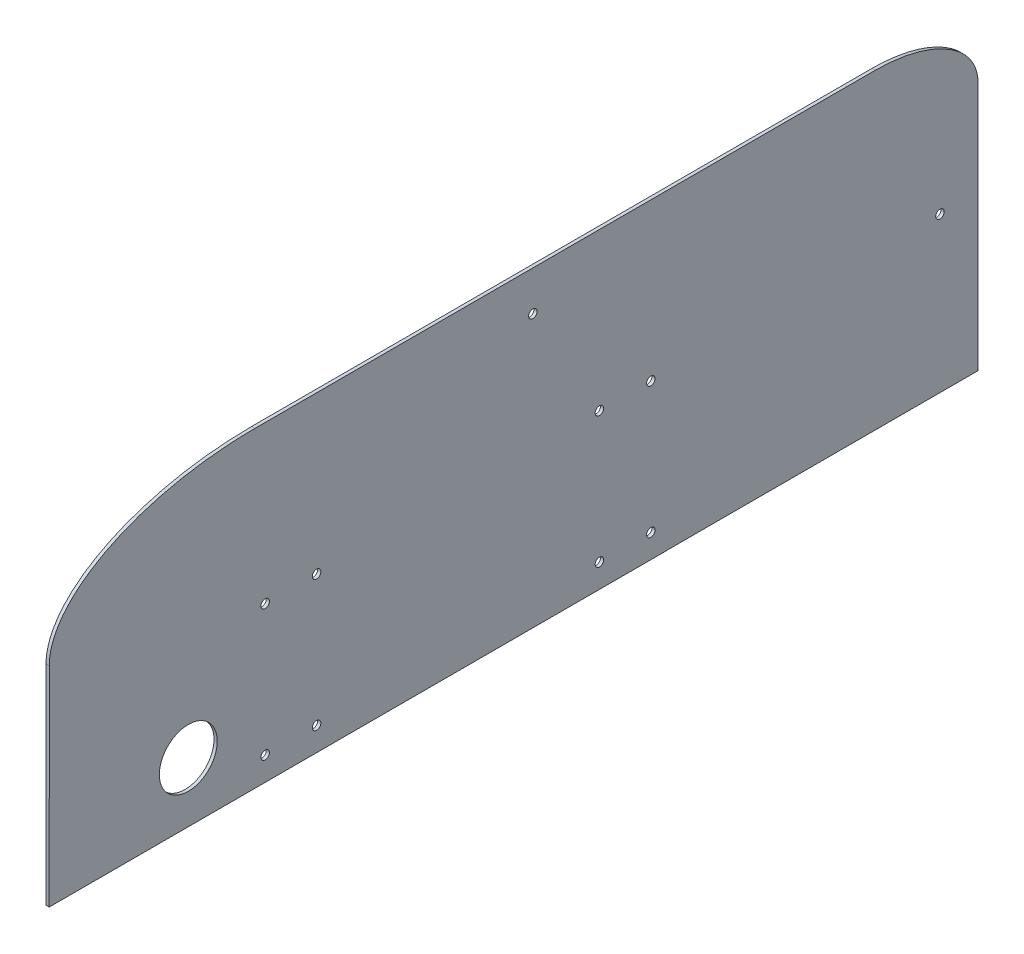
ISO-10303-21;
HEADER;
FILE_DESCRIPTION(('STEP AP214'),'2;1');
FILE_NAME('part.step','',(''),(''),'','','');
FILE_SCHEMA(('AUTOMOTIVE_DESIGN { 1 0 10303 214 1 1 1 1 }'));
ENDSEC;
DATA;
#1=APPLICATION_CONTEXT('core data for automotive mechanical design processes');
#2=APPLICATION_PROTOCOL_DEFINITION('international standard','automotive_design',2000,#1);
#3=PRODUCT_CONTEXT('',#1,'mechanical');
#4=PRODUCT('Part','Part','',(#3));
#5=PRODUCT_RELATED_PRODUCT_CATEGORY('part','',(#4));
#6=PRODUCT_DEFINITION_FORMATION('','',#4);
#7=PRODUCT_DEFINITION_CONTEXT('part definition',#1,'design');
#8=PRODUCT_DEFINITION('design','',#6,#7);
#9=PRODUCT_DEFINITION_SHAPE('','',#8);
#10=(LENGTH_UNIT() NAMED_UNIT(*) SI_UNIT(.MILLI.,.METRE.));
#11=(NAMED_UNIT(*) PLANE_ANGLE_UNIT() SI_UNIT($,.RADIAN.));
#12=(NAMED_UNIT(*) SI_UNIT($,.STERADIAN.) SOLID_ANGLE_UNIT());
#13=UNCERTAINTY_MEASURE_WITH_UNIT(LENGTH_MEASURE(1.E-05),#10,'distance_accuracy_value','');
#14=(GEOMETRIC_REPRESENTATION_CONTEXT(3) GLOBAL_UNCERTAINTY_ASSIGNED_CONTEXT((#13)) GLOBAL_UNIT_ASSIGNED_CONTEXT((#10,
#11,#12)) REPRESENTATION_CONTEXT('',''));
#15=CARTESIAN_POINT('',(0.,0.,0.));
#16=DIRECTION('',(0.,0.,1.));
#17=DIRECTION('',(1.,0.,0.));
#18=AXIS2_PLACEMENT_3D('',#15,#16,#17);
#19=CARTESIAN_POINT('',(1.5875,-58.42,-152.4));
#20=DIRECTION('',(0.,0.,1.));
#21=DIRECTION('',(0.,-1.,0.));
#22=AXIS2_PLACEMENT_3D('',#19,#20,#21);
#23=PLANE('',#22);
#24=DIRECTION('',(-1.,0.,0.));
#25=VECTOR('',#24,1.);
#26=CARTESIAN_POINT('',(485.507501583164,-58.3565,-152.4));
#27=LINE('',#26,#25);
#28=CARTESIAN_POINT('',(1.5875,-58.3565,-152.4));
#29=VERTEX_POINT('',#28);
#30=CARTESIAN_POINT('',(0.,-58.3565,-152.4));
#31=VERTEX_POINT('',#30);
#32=EDGE_CURVE('E134',#29,#31,#27,.T.);
#33=ORIENTED_EDGE('',*,*,#32,.F.);
#34=DIRECTION('',(0.,1.,0.));
#35=VECTOR('',#34,1.);
#36=CARTESIAN_POINT('',(1.5875,-58.42,-152.4));
#37=LINE('',#36,#35);
#38=CARTESIAN_POINT('',(1.5875,-58.42,-152.4));
#39=VERTEX_POINT('',#38);
#40=EDGE_CURVE('E363',#39,#29,#37,.T.);
#41=ORIENTED_EDGE('',*,*,#40,.F.);
#42=DIRECTION('',(-1.,0.,0.));
#43=VECTOR('',#42,1.);
#44=CARTESIAN_POINT('',(1.5875,-58.42,-152.4));
#45=LINE('',#44,#43);
#46=CARTESIAN_POINT('',(0.,-58.42,-152.4));
#47=VERTEX_POINT('',#46);
#48=EDGE_CURVE('E340',#39,#47,#45,.T.);
#49=ORIENTED_EDGE('',*,*,#48,.T.);
#50=DIRECTION('',(0.,1.,0.));
#51=VECTOR('',#50,1.);
#52=CARTESIAN_POINT('',(0.,-58.42,-152.4));
#53=LINE('',#52,#51);
#54=EDGE_CURVE('E356',#47,#31,#53,.T.);
#55=ORIENTED_EDGE('',*,*,#54,.T.);
#56=EDGE_LOOP('',(#33,#41,#49,#55));
#57=FACE_BOUND('',#56,.T.);
#58=ADVANCED_FACE('F46',(#57),#23,.F.);
#59=CARTESIAN_POINT('',(1.5875,-58.42,152.4));
#60=DIRECTION('',(0.,0.,-1.));
#61=DIRECTION('',(-1.,0.,0.));
#62=AXIS2_PLACEMENT_3D('',#59,#60,#61);
#63=PLANE('',#62);
#64=DIRECTION('',(0.,-1.,0.));
#65=VECTOR('',#64,1.);
#66=CARTESIAN_POINT('',(1.5875,-58.42,152.4));
#67=LINE('',#66,#65);
#68=CARTESIAN_POINT('',(1.62718750000001,44.7675,152.4));
#69=VERTEX_POINT('',#68);
#70=CARTESIAN_POINT('',(1.5875,-58.42,152.4));
#71=VERTEX_POINT('',#70);
#72=EDGE_CURVE('E357',#69,#71,#67,.T.);
#73=ORIENTED_EDGE('',*,*,#72,.F.);
#74=CARTESIAN_POINT('',(-0.0793750000000009,44.7675,152.4));
#75=CARTESIAN_POINT('',(0.50270833333334,44.7675,152.4));
#76=CARTESIAN_POINT('',(1.08479166666668,44.7675,152.4));
#77=CARTESIAN_POINT('',(1.66687500000002,44.7675,152.4));
#78=(BOUNDED_CURVE() B_SPLINE_CURVE(3,(#74,#75,#76,#77),.UNSPECIFIED.,.F.,
.F.) B_SPLINE_CURVE_WITH_KNOTS((4,4),(-0.001666875,7.93750000000205E-05),
.UNSPECIFIED.) CURVE() GEOMETRIC_REPRESENTATION_ITEM() RATIONAL_B_SPLINE_CURVE((1.,1.,1.,1.)) REPRESENTATION_ITEM(''));
#79=CARTESIAN_POINT('',(0.,44.7675,152.4));
#80=VERTEX_POINT('',#79);
#81=EDGE_CURVE('E334',#69,#80,#78,.F.);
#82=ORIENTED_EDGE('',*,*,#81,.T.);
#83=DIRECTION('',(0.,-1.,0.));
#84=VECTOR('',#83,1.);
#85=CARTESIAN_POINT('',(0.,-58.42,152.4));
#86=LINE('',#85,#84);
#87=CARTESIAN_POINT('',(0.,-58.42,152.4));
#88=VERTEX_POINT('',#87);
#89=EDGE_CURVE('E351',#80,#88,#86,.T.);
#90=ORIENTED_EDGE('',*,*,#89,.T.);
#91=DIRECTION('',(-1.,0.,0.));
#92=VECTOR('',#91,1.);
#93=CARTESIAN_POINT('',(1.5875,-58.42,152.4));
#94=LINE('',#93,#92);
#95=EDGE_CURVE('E336',#71,#88,#94,.T.);
#96=ORIENTED_EDGE('',*,*,#95,.F.);
#97=EDGE_LOOP('',(#73,#82,#90,#96));
#98=FACE_BOUND('',#97,.T.);
#99=ADVANCED_FACE('F245',(#98),#63,.F.);
#100=CARTESIAN_POINT('',(1.5875,-58.42,152.4));
#101=DIRECTION('',(0.,1.,0.));
#102=DIRECTION('',(0.,0.,1.));
#103=AXIS2_PLACEMENT_3D('',#100,#101,#102);
#104=PLANE('',#103);
#105=DIRECTION('',(0.,0.,-1.));
#106=VECTOR('',#105,1.);
#107=CARTESIAN_POINT('',(0.,-58.42,152.4));
#108=LINE('',#107,#106);
#109=EDGE_CURVE('E355',#88,#47,#108,.T.);
#110=ORIENTED_EDGE('',*,*,#109,.T.);
#111=ORIENTED_EDGE('',*,*,#48,.F.);
#112=DIRECTION('',(0.,0.,-1.));
#113=VECTOR('',#112,1.);
#114=CARTESIAN_POINT('',(1.5875,-58.42,152.4));
#115=LINE('',#114,#113);
#116=EDGE_CURVE('E347',#71,#39,#115,.T.);
#117=ORIENTED_EDGE('',*,*,#116,.F.);
#118=ORIENTED_EDGE('',*,*,#95,.T.);
#119=EDGE_LOOP('',(#110,#111,#117,#118));
#120=FACE_BOUND('',#119,.T.);
#121=ADVANCED_FACE('F242',(#120),#104,.F.);
#122=CARTESIAN_POINT('',(1.5875,0.,0.));
#123=DIRECTION('',(-1.,0.,0.));
#124=DIRECTION('',(0.,0.,1.));
#125=AXIS2_PLACEMENT_3D('',#122,#123,#124);
#126=PLANE('',#125);
#127=CARTESIAN_POINT('',(1.5875,75.936579902,-86.5099811579999));
#128=DIRECTION('',(-1.,0.,0.));
#129=DIRECTION('',(0.,0.,1.));
#130=AXIS2_PLACEMENT_3D('',#127,#128,#129);
#131=CIRCLE('',#130,2.0955);
#132=CARTESIAN_POINT('',(1.5875,75.936579902,-84.4144811579999));
#133=VERTEX_POINT('',#132);
#134=EDGE_CURVE('E518',#133,#133,#131,.F.);
#135=ORIENTED_EDGE('',*,*,#134,.F.);
#136=EDGE_LOOP('',(#135));
#137=FACE_BOUND('',#136,.T.);
#138=CARTESIAN_POINT('',(1.5875,18.034,-287.5915));
#139=DIRECTION('',(-1.,0.,0.));
#140=DIRECTION('',(0.,0.,1.));
#141=AXIS2_PLACEMENT_3D('',#138,#139,#140);
#142=CIRCLE('',#141,2.09549999999999);
#143=CARTESIAN_POINT('',(1.5875,18.034,-285.496));
#144=VERTEX_POINT('',#143);
#145=EDGE_CURVE('E217',#144,#144,#142,.F.);
#146=ORIENTED_EDGE('',*,*,#145,.F.);
#147=EDGE_LOOP('',(#146));
#148=FACE_BOUND('',#147,.T.);
#149=DIRECTION('',(0.,1.,0.));
#150=VECTOR('',#149,1.);
#151=CARTESIAN_POINT('',(1.58750000000002,0.,-306.3875));
#152=LINE('',#151,#150);
#153=CARTESIAN_POINT('',(1.58750000000002,-58.3565,-306.3875));
#154=VERTEX_POINT('',#153);
#155=CARTESIAN_POINT('',(1.58750000000002,65.0875,-306.3875));
#156=VERTEX_POINT('',#155);
#157=EDGE_CURVE('E130',#154,#156,#152,.T.);
#158=ORIENTED_EDGE('',*,*,#157,.T.);
#159=CARTESIAN_POINT('',(1.58750000000002,95.5675,-255.5875));
#160=CARTESIAN_POINT('',(1.58750000000002,95.5675,-306.3875));
#161=CARTESIAN_POINT('',(1.58750000000002,65.0875,-306.3875));
#162=(BOUNDED_CURVE() B_SPLINE_CURVE(2,(#159,#160,#161),.UNSPECIFIED.,.F.,
.F.) B_SPLINE_CURVE_WITH_KNOTS((3,3),(0.,1.),
.UNSPECIFIED.) CURVE() GEOMETRIC_REPRESENTATION_ITEM() RATIONAL_B_SPLINE_CURVE((1.,
0.707106781186548,1.)) REPRESENTATION_ITEM(''));
#163=CARTESIAN_POINT('',(1.58750000000002,95.5675,-255.5875));
#164=VERTEX_POINT('',#163);
#165=EDGE_CURVE('E13',#156,#164,#162,.F.);
#166=ORIENTED_EDGE('',*,*,#165,.T.);
#167=DIRECTION('',(0.,0.,1.));
#168=VECTOR('',#167,1.);
#169=CARTESIAN_POINT('',(1.58750000000002,95.5675,0.));
#170=LINE('',#169,#168);
#171=CARTESIAN_POINT('',(1.58750000000002,95.5675,50.8));
#172=VERTEX_POINT('',#171);
#173=EDGE_CURVE('E154',#164,#172,#170,.T.);
#174=ORIENTED_EDGE('',*,*,#173,.T.);
#175=CARTESIAN_POINT('',(1.5875,44.7675,152.4));
#176=CARTESIAN_POINT('',(1.5875,95.5675,152.4));
#177=CARTESIAN_POINT('',(1.5875,95.5675,50.8));
#178=(BOUNDED_CURVE() B_SPLINE_CURVE(2,(#175,#176,#177),.UNSPECIFIED.,.F.,
.F.) B_SPLINE_CURVE_WITH_KNOTS((3,3),(0.,1.),
.UNSPECIFIED.) CURVE() GEOMETRIC_REPRESENTATION_ITEM() RATIONAL_B_SPLINE_CURVE((1.,
0.707106781186547,1.)) REPRESENTATION_ITEM(''));
#179=EDGE_CURVE('E330',#172,#69,#178,.F.);
#180=ORIENTED_EDGE('',*,*,#179,.T.);
#181=ORIENTED_EDGE('',*,*,#72,.T.);
#182=ORIENTED_EDGE('',*,*,#116,.T.);
#183=ORIENTED_EDGE('',*,*,#40,.T.);
#184=DIRECTION('',(0.,0.,1.));
#185=VECTOR('',#184,1.);
#186=CARTESIAN_POINT('',(1.58750000000002,-58.3565,0.));
#187=LINE('',#186,#185);
#188=EDGE_CURVE('E145',#154,#29,#187,.T.);
#189=ORIENTED_EDGE('',*,*,#188,.F.);
#190=EDGE_LOOP('',(#158,#166,#174,#180,#181,#182,#183,#189));
#191=FACE_BOUND('',#190,.T.);
#192=CARTESIAN_POINT('',(1.5875,-28.956,83.7057));
#193=DIRECTION('',(-1.,0.,0.));
#194=DIRECTION('',(0.,0.,1.));
#195=AXIS2_PLACEMENT_3D('',#192,#193,#194);
#196=CIRCLE('',#195,14.2875);
#197=CARTESIAN_POINT('',(1.5875,-28.956,97.9932));
#198=VERTEX_POINT('',#197);
#199=EDGE_CURVE('E430',#198,#198,#196,.T.);
#200=ORIENTED_EDGE('',*,*,#199,.T.);
#201=EDGE_LOOP('',(#200));
#202=FACE_BOUND('',#201,.T.);
#203=CARTESIAN_POINT('',(1.5875,-46.736,-144.78));
#204=DIRECTION('',(1.,0.,0.));
#205=DIRECTION('',(0.,0.,-1.));
#206=AXIS2_PLACEMENT_3D('',#203,#204,#205);
#207=CIRCLE('',#206,2.09550000000002);
#208=CARTESIAN_POINT('',(1.5875,-46.736,-146.8755));
#209=VERTEX_POINT('',#208);
#210=EDGE_CURVE('E390',#209,#209,#207,.T.);
#211=ORIENTED_EDGE('',*,*,#210,.F.);
#212=EDGE_LOOP('',(#211));
#213=FACE_BOUND('',#212,.T.);
#214=CARTESIAN_POINT('',(1.5875,-46.736,-119.38));
#215=DIRECTION('',(1.,0.,0.));
#216=DIRECTION('',(0.,0.,-1.));
#217=AXIS2_PLACEMENT_3D('',#214,#215,#216);
#218=CIRCLE('',#217,2.0955);
#219=CARTESIAN_POINT('',(1.5875,-46.736,-121.4755));
#220=VERTEX_POINT('',#219);
#221=EDGE_CURVE('E407',#220,#220,#218,.T.);
#222=ORIENTED_EDGE('',*,*,#221,.F.);
#223=EDGE_LOOP('',(#222));
#224=FACE_BOUND('',#223,.T.);
#225=CARTESIAN_POINT('',(1.5875,18.034,45.7200000000002));
#226=DIRECTION('',(1.,0.,0.));
#227=DIRECTION('',(0.,0.,-1.));
#228=AXIS2_PLACEMENT_3D('',#225,#226,#227);
#229=CIRCLE('',#228,2.0955);
#230=CARTESIAN_POINT('',(1.5875,18.034,43.6245000000002));
#231=VERTEX_POINT('',#230);
#232=EDGE_CURVE('E397',#231,#231,#229,.T.);
#233=ORIENTED_EDGE('',*,*,#232,.F.);
#234=EDGE_LOOP('',(#233));
#235=FACE_BOUND('',#234,.T.);
#236=CARTESIAN_POINT('',(1.5875,18.034,20.3200000000002));
#237=DIRECTION('',(1.,0.,0.));
#238=DIRECTION('',(0.,0.,-1.));
#239=AXIS2_PLACEMENT_3D('',#236,#237,#238);
#240=CIRCLE('',#239,2.0955);
#241=CARTESIAN_POINT('',(1.5875,18.034,18.2245000000002));
#242=VERTEX_POINT('',#241);
#243=EDGE_CURVE('E398',#242,#242,#240,.T.);
#244=ORIENTED_EDGE('',*,*,#243,.F.);
#245=EDGE_LOOP('',(#244));
#246=FACE_BOUND('',#245,.T.);
#247=CARTESIAN_POINT('',(1.5875,18.034,-119.38));
#248=DIRECTION('',(1.,0.,0.));
#249=DIRECTION('',(0.,0.,-1.));
#250=AXIS2_PLACEMENT_3D('',#247,#248,#249);
#251=CIRCLE('',#250,2.0955);
#252=CARTESIAN_POINT('',(1.5875,18.034,-121.4755));
#253=VERTEX_POINT('',#252);
#254=EDGE_CURVE('E435',#253,#253,#251,.T.);
#255=ORIENTED_EDGE('',*,*,#254,.F.);
#256=EDGE_LOOP('',(#255));
#257=FACE_BOUND('',#256,.T.);
#258=CARTESIAN_POINT('',(1.5875,18.034,-144.78));
#259=DIRECTION('',(1.,0.,0.));
#260=DIRECTION('',(0.,0.,-1.));
#261=AXIS2_PLACEMENT_3D('',#258,#259,#260);
#262=CIRCLE('',#261,2.09550000000002);
#263=CARTESIAN_POINT('',(1.5875,18.034,-146.8755));
#264=VERTEX_POINT('',#263);
#265=EDGE_CURVE('E425',#264,#264,#262,.T.);
#266=ORIENTED_EDGE('',*,*,#265,.F.);
#267=EDGE_LOOP('',(#266));
#268=FACE_BOUND('',#267,.T.);
#269=CARTESIAN_POINT('',(1.5875,-46.736,20.32));
#270=DIRECTION('',(1.,0.,0.));
#271=DIRECTION('',(0.,0.,-1.));
#272=AXIS2_PLACEMENT_3D('',#269,#270,#271);
#273=CIRCLE('',#272,2.0955);
#274=CARTESIAN_POINT('',(1.5875,-46.736,18.2245));
#275=VERTEX_POINT('',#274);
#276=EDGE_CURVE('E426',#275,#275,#273,.T.);
#277=ORIENTED_EDGE('',*,*,#276,.F.);
#278=EDGE_LOOP('',(#277));
#279=FACE_BOUND('',#278,.T.);
#280=CARTESIAN_POINT('',(1.5875,-46.736,45.72));
#281=DIRECTION('',(1.,0.,0.));
#282=DIRECTION('',(0.,0.,-1.));
#283=AXIS2_PLACEMENT_3D('',#280,#281,#282);
#284=CIRCLE('',#283,2.0955);
#285=CARTESIAN_POINT('',(1.5875,-46.736,43.6245));
#286=VERTEX_POINT('',#285);
#287=EDGE_CURVE('E380',#286,#286,#284,.T.);
#288=ORIENTED_EDGE('',*,*,#287,.F.);
#289=EDGE_LOOP('',(#288));
#290=FACE_BOUND('',#289,.T.);
#291=ADVANCED_FACE('F238',(#137,#148,#191,#202,#213,#224,#235,#246,#257,#268,#279,#290),#126,.F.);
#292=CARTESIAN_POINT('',(0.,0.,0.));
#293=DIRECTION('',(-1.,0.,0.));
#294=DIRECTION('',(0.,0.,1.));
#295=AXIS2_PLACEMENT_3D('',#292,#293,#294);
#296=PLANE('',#295);
#297=CARTESIAN_POINT('',(0.,75.936579902,-86.5099811579999));
#298=DIRECTION('',(-1.,0.,0.));
#299=DIRECTION('',(0.,0.,1.));
#300=AXIS2_PLACEMENT_3D('',#297,#298,#299);
#301=CIRCLE('',#300,2.0955);
#302=CARTESIAN_POINT('',(0.,75.936579902,-84.4144811579999));
#303=VERTEX_POINT('',#302);
#304=EDGE_CURVE('E530',#303,#303,#301,.T.);
#305=ORIENTED_EDGE('',*,*,#304,.F.);
#306=EDGE_LOOP('',(#305));
#307=FACE_BOUND('',#306,.T.);
#308=CARTESIAN_POINT('',(0.,18.034,-287.5915));
#309=DIRECTION('',(-1.,0.,0.));
#310=DIRECTION('',(0.,0.,1.));
#311=AXIS2_PLACEMENT_3D('',#308,#309,#310);
#312=CIRCLE('',#311,2.09549999999999);
#313=CARTESIAN_POINT('',(0.,18.034,-285.496));
#314=VERTEX_POINT('',#313);
#315=EDGE_CURVE('E523',#314,#314,#312,.T.);
#316=ORIENTED_EDGE('',*,*,#315,.F.);
#317=EDGE_LOOP('',(#316));
#318=FACE_BOUND('',#317,.T.);
#319=DIRECTION('',(0.,0.,-1.));
#320=VECTOR('',#319,1.);
#321=CARTESIAN_POINT('',(0.,95.5675,0.));
#322=LINE('',#321,#320);
#323=CARTESIAN_POINT('',(-0.0396875000000005,95.5675,50.8));
#324=VERTEX_POINT('',#323);
#325=CARTESIAN_POINT('',(0.,95.5675,-255.5875));
#326=VERTEX_POINT('',#325);
#327=EDGE_CURVE('E125',#324,#326,#322,.T.);
#328=ORIENTED_EDGE('',*,*,#327,.T.);
#329=CARTESIAN_POINT('',(0.,65.0875,-306.3875));
#330=CARTESIAN_POINT('',(0.,95.5675,-306.3875));
#331=CARTESIAN_POINT('',(0.,95.5675,-255.5875));
#332=(BOUNDED_CURVE() B_SPLINE_CURVE(2,(#329,#330,#331),.UNSPECIFIED.,.F.,
.F.) B_SPLINE_CURVE_WITH_KNOTS((3,3),(0.,1.),
.UNSPECIFIED.) CURVE() GEOMETRIC_REPRESENTATION_ITEM() RATIONAL_B_SPLINE_CURVE((1.,
0.707106781186548,1.)) REPRESENTATION_ITEM(''));
#333=CARTESIAN_POINT('',(0.,65.0875,-306.3875));
#334=VERTEX_POINT('',#333);
#335=EDGE_CURVE('E76',#326,#334,#332,.F.);
#336=ORIENTED_EDGE('',*,*,#335,.T.);
#337=DIRECTION('',(0.,-1.,0.));
#338=VECTOR('',#337,1.);
#339=CARTESIAN_POINT('',(0.,0.,-306.3875));
#340=LINE('',#339,#338);
#341=CARTESIAN_POINT('',(0.,-58.3565,-306.3875));
#342=VERTEX_POINT('',#341);
#343=EDGE_CURVE('E117',#334,#342,#340,.T.);
#344=ORIENTED_EDGE('',*,*,#343,.T.);
#345=DIRECTION('',(0.,0.,-1.));
#346=VECTOR('',#345,1.);
#347=CARTESIAN_POINT('',(0.,-58.3565,0.));
#348=LINE('',#347,#346);
#349=EDGE_CURVE('E123',#31,#342,#348,.T.);
#350=ORIENTED_EDGE('',*,*,#349,.F.);
#351=ORIENTED_EDGE('',*,*,#54,.F.);
#352=ORIENTED_EDGE('',*,*,#109,.F.);
#353=ORIENTED_EDGE('',*,*,#89,.F.);
#354=CARTESIAN_POINT('',(0.,95.5675,50.8));
#355=CARTESIAN_POINT('',(0.,95.5675,152.4));
#356=CARTESIAN_POINT('',(0.,44.7675,152.4));
#357=(BOUNDED_CURVE() B_SPLINE_CURVE(2,(#354,#355,#356),.UNSPECIFIED.,.F.,
.F.) B_SPLINE_CURVE_WITH_KNOTS((3,3),(0.,1.),
.UNSPECIFIED.) CURVE() GEOMETRIC_REPRESENTATION_ITEM() RATIONAL_B_SPLINE_CURVE((1.,
0.707106781186547,1.)) REPRESENTATION_ITEM(''));
#358=EDGE_CURVE('E224',#80,#324,#357,.F.);
#359=ORIENTED_EDGE('',*,*,#358,.T.);
#360=EDGE_LOOP('',(#328,#336,#344,#350,#351,#352,#353,#359));
#361=FACE_BOUND('',#360,.T.);
#362=CARTESIAN_POINT('',(0.,-28.956,83.7057));
#363=DIRECTION('',(-1.,0.,0.));
#364=DIRECTION('',(0.,0.,1.));
#365=AXIS2_PLACEMENT_3D('',#362,#363,#364);
#366=CIRCLE('',#365,14.2875);
#367=CARTESIAN_POINT('',(0.,-28.956,97.9932));
#368=VERTEX_POINT('',#367);
#369=EDGE_CURVE('E149',#368,#368,#366,.T.);
#370=ORIENTED_EDGE('',*,*,#369,.F.);
#371=EDGE_LOOP('',(#370));
#372=FACE_BOUND('',#371,.T.);
#373=CARTESIAN_POINT('',(0.,-46.736,-144.78));
#374=DIRECTION('',(-1.,0.,0.));
#375=DIRECTION('',(0.,0.,1.));
#376=AXIS2_PLACEMENT_3D('',#373,#374,#375);
#377=CIRCLE('',#376,2.09550000000002);
#378=CARTESIAN_POINT('',(0.,-46.736,-142.6845));
#379=VERTEX_POINT('',#378);
#380=EDGE_CURVE('E385',#379,#379,#377,.F.);
#381=ORIENTED_EDGE('',*,*,#380,.T.);
#382=EDGE_LOOP('',(#381));
#383=FACE_BOUND('',#382,.T.);
#384=CARTESIAN_POINT('',(0.,-46.736,-119.38));
#385=DIRECTION('',(-1.,0.,0.));
#386=DIRECTION('',(0.,0.,1.));
#387=AXIS2_PLACEMENT_3D('',#384,#385,#386);
#388=CIRCLE('',#387,2.0955);
#389=CARTESIAN_POINT('',(0.,-46.736,-117.2845));
#390=VERTEX_POINT('',#389);
#391=EDGE_CURVE('E411',#390,#390,#388,.F.);
#392=ORIENTED_EDGE('',*,*,#391,.T.);
#393=EDGE_LOOP('',(#392));
#394=FACE_BOUND('',#393,.T.);
#395=CARTESIAN_POINT('',(0.,18.034,45.7200000000002));
#396=DIRECTION('',(-1.,0.,0.));
#397=DIRECTION('',(0.,0.,1.));
#398=AXIS2_PLACEMENT_3D('',#395,#396,#397);
#399=CIRCLE('',#398,2.0955);
#400=CARTESIAN_POINT('',(0.,18.034,47.8155000000002));
#401=VERTEX_POINT('',#400);
#402=EDGE_CURVE('E403',#401,#401,#399,.F.);
#403=ORIENTED_EDGE('',*,*,#402,.T.);
#404=EDGE_LOOP('',(#403));
#405=FACE_BOUND('',#404,.T.);
#406=CARTESIAN_POINT('',(0.,18.034,20.3200000000002));
#407=DIRECTION('',(-1.,0.,0.));
#408=DIRECTION('',(0.,0.,1.));
#409=AXIS2_PLACEMENT_3D('',#406,#407,#408);
#410=CIRCLE('',#409,2.0955);
#411=CARTESIAN_POINT('',(0.,18.034,22.4155000000002));
#412=VERTEX_POINT('',#411);
#413=EDGE_CURVE('E393',#412,#412,#410,.F.);
#414=ORIENTED_EDGE('',*,*,#413,.T.);
#415=EDGE_LOOP('',(#414));
#416=FACE_BOUND('',#415,.T.);
#417=CARTESIAN_POINT('',(0.,18.034,-119.38));
#418=DIRECTION('',(-1.,0.,0.));
#419=DIRECTION('',(0.,0.,1.));
#420=AXIS2_PLACEMENT_3D('',#417,#418,#419);
#421=CIRCLE('',#420,2.0955);
#422=CARTESIAN_POINT('',(0.,18.034,-117.2845));
#423=VERTEX_POINT('',#422);
#424=EDGE_CURVE('E402',#423,#423,#421,.F.);
#425=ORIENTED_EDGE('',*,*,#424,.T.);
#426=EDGE_LOOP('',(#425));
#427=FACE_BOUND('',#426,.T.);
#428=CARTESIAN_POINT('',(0.,18.034,-144.78));
#429=DIRECTION('',(-1.,0.,0.));
#430=DIRECTION('',(0.,0.,1.));
#431=AXIS2_PLACEMENT_3D('',#428,#429,#430);
#432=CIRCLE('',#431,2.09550000000002);
#433=CARTESIAN_POINT('',(0.,18.034,-142.6845));
#434=VERTEX_POINT('',#433);
#435=EDGE_CURVE('E431',#434,#434,#432,.F.);
#436=ORIENTED_EDGE('',*,*,#435,.T.);
#437=EDGE_LOOP('',(#436));
#438=FACE_BOUND('',#437,.T.);
#439=CARTESIAN_POINT('',(0.,-46.736,20.32));
#440=DIRECTION('',(-1.,0.,0.));
#441=DIRECTION('',(0.,0.,1.));
#442=AXIS2_PLACEMENT_3D('',#439,#440,#441);
#443=CIRCLE('',#442,2.0955);
#444=CARTESIAN_POINT('',(0.,-46.736,22.4155));
#445=VERTEX_POINT('',#444);
#446=EDGE_CURVE('E421',#445,#445,#443,.F.);
#447=ORIENTED_EDGE('',*,*,#446,.T.);
#448=EDGE_LOOP('',(#447));
#449=FACE_BOUND('',#448,.T.);
#450=CARTESIAN_POINT('',(0.,-46.736,45.72));
#451=DIRECTION('',(-1.,0.,0.));
#452=DIRECTION('',(0.,0.,1.));
#453=AXIS2_PLACEMENT_3D('',#450,#451,#452);
#454=CIRCLE('',#453,2.0955);
#455=CARTESIAN_POINT('',(0.,-46.736,47.8155));
#456=VERTEX_POINT('',#455);
#457=EDGE_CURVE('E372',#456,#456,#454,.F.);
#458=ORIENTED_EDGE('',*,*,#457,.T.);
#459=EDGE_LOOP('',(#458));
#460=FACE_BOUND('',#459,.T.);
#461=ADVANCED_FACE('F119',(#307,#318,#361,#372,#383,#394,#405,#416,#427,#438,#449,#460),#296,.T.);
#462=CARTESIAN_POINT('',(-5.9269690399057,-46.736,45.72));
#463=DIRECTION('',(1.,0.,0.));
#464=DIRECTION('',(0.,0.,-1.));
#465=AXIS2_PLACEMENT_3D('',#462,#463,#464);
#466=CYLINDRICAL_SURFACE('',#465,2.0955);
#467=ORIENTED_EDGE('',*,*,#287,.T.);
#468=EDGE_LOOP('',(#467));
#469=FACE_BOUND('',#468,.T.);
#470=ORIENTED_EDGE('',*,*,#457,.F.);
#471=EDGE_LOOP('',(#470));
#472=FACE_BOUND('',#471,.T.);
#473=ADVANCED_FACE('F237',(#469,#472),#466,.F.);
#474=CARTESIAN_POINT('',(-5.9269690399057,-46.736,20.32));
#475=DIRECTION('',(1.,0.,0.));
#476=DIRECTION('',(0.,0.,-1.));
#477=AXIS2_PLACEMENT_3D('',#474,#475,#476);
#478=CYLINDRICAL_SURFACE('',#477,2.0955);
#479=ORIENTED_EDGE('',*,*,#276,.T.);
#480=EDGE_LOOP('',(#479));
#481=FACE_BOUND('',#480,.T.);
#482=ORIENTED_EDGE('',*,*,#446,.F.);
#483=EDGE_LOOP('',(#482));
#484=FACE_BOUND('',#483,.T.);
#485=ADVANCED_FACE('F467',(#481,#484),#478,.F.);
#486=CARTESIAN_POINT('',(-5.9269690399057,18.034,-144.78));
#487=DIRECTION('',(1.,0.,0.));
#488=DIRECTION('',(0.,0.,-1.));
#489=AXIS2_PLACEMENT_3D('',#486,#487,#488);
#490=CYLINDRICAL_SURFACE('',#489,2.09550000000002);
#491=ORIENTED_EDGE('',*,*,#265,.T.);
#492=EDGE_LOOP('',(#491));
#493=FACE_BOUND('',#492,.T.);
#494=ORIENTED_EDGE('',*,*,#435,.F.);
#495=EDGE_LOOP('',(#494));
#496=FACE_BOUND('',#495,.T.);
#497=ADVANCED_FACE('F469',(#493,#496),#490,.F.);
#498=CARTESIAN_POINT('',(-5.9269690399057,18.034,-119.38));
#499=DIRECTION('',(1.,0.,0.));
#500=DIRECTION('',(0.,0.,-1.));
#501=AXIS2_PLACEMENT_3D('',#498,#499,#500);
#502=CYLINDRICAL_SURFACE('',#501,2.0955);
#503=ORIENTED_EDGE('',*,*,#254,.T.);
#504=EDGE_LOOP('',(#503));
#505=FACE_BOUND('',#504,.T.);
#506=ORIENTED_EDGE('',*,*,#424,.F.);
#507=EDGE_LOOP('',(#506));
#508=FACE_BOUND('',#507,.T.);
#509=ADVANCED_FACE('F476',(#505,#508),#502,.F.);
#510=CARTESIAN_POINT('',(-5.9269690399057,18.034,20.3200000000002));
#511=DIRECTION('',(1.,0.,0.));
#512=DIRECTION('',(0.,0.,-1.));
#513=AXIS2_PLACEMENT_3D('',#510,#511,#512);
#514=CYLINDRICAL_SURFACE('',#513,2.0955);
#515=ORIENTED_EDGE('',*,*,#243,.T.);
#516=EDGE_LOOP('',(#515));
#517=FACE_BOUND('',#516,.T.);
#518=ORIENTED_EDGE('',*,*,#413,.F.);
#519=EDGE_LOOP('',(#518));
#520=FACE_BOUND('',#519,.T.);
#521=ADVANCED_FACE('F491',(#517,#520),#514,.F.);
#522=CARTESIAN_POINT('',(-5.9269690399057,18.034,45.7200000000002));
#523=DIRECTION('',(1.,0.,0.));
#524=DIRECTION('',(0.,0.,-1.));
#525=AXIS2_PLACEMENT_3D('',#522,#523,#524);
#526=CYLINDRICAL_SURFACE('',#525,2.0955);
#527=ORIENTED_EDGE('',*,*,#232,.T.);
#528=EDGE_LOOP('',(#527));
#529=FACE_BOUND('',#528,.T.);
#530=ORIENTED_EDGE('',*,*,#402,.F.);
#531=EDGE_LOOP('',(#530));
#532=FACE_BOUND('',#531,.T.);
#533=ADVANCED_FACE('F487',(#529,#532),#526,.F.);
#534=CARTESIAN_POINT('',(-5.9269690399057,-46.736,-119.38));
#535=DIRECTION('',(1.,0.,0.));
#536=DIRECTION('',(0.,0.,-1.));
#537=AXIS2_PLACEMENT_3D('',#534,#535,#536);
#538=CYLINDRICAL_SURFACE('',#537,2.0955);
#539=ORIENTED_EDGE('',*,*,#221,.T.);
#540=EDGE_LOOP('',(#539));
#541=FACE_BOUND('',#540,.T.);
#542=ORIENTED_EDGE('',*,*,#391,.F.);
#543=EDGE_LOOP('',(#542));
#544=FACE_BOUND('',#543,.T.);
#545=ADVANCED_FACE('F483',(#541,#544),#538,.F.);
#546=CARTESIAN_POINT('',(-5.9269690399057,-46.736,-144.78));
#547=DIRECTION('',(1.,0.,0.));
#548=DIRECTION('',(0.,0.,-1.));
#549=AXIS2_PLACEMENT_3D('',#546,#547,#548);
#550=CYLINDRICAL_SURFACE('',#549,2.09550000000002);
#551=ORIENTED_EDGE('',*,*,#210,.T.);
#552=EDGE_LOOP('',(#551));
#553=FACE_BOUND('',#552,.T.);
#554=ORIENTED_EDGE('',*,*,#380,.F.);
#555=EDGE_LOOP('',(#554));
#556=FACE_BOUND('',#555,.T.);
#557=ADVANCED_FACE('F480',(#553,#556),#550,.F.);
#558=CARTESIAN_POINT('',(3.175,-28.956,83.7057));
#559=DIRECTION('',(-1.,0.,0.));
#560=DIRECTION('',(0.,0.,1.));
#561=AXIS2_PLACEMENT_3D('',#558,#559,#560);
#562=CYLINDRICAL_SURFACE('',#561,14.2875);
#563=ORIENTED_EDGE('',*,*,#369,.T.);
#564=EDGE_LOOP('',(#563));
#565=FACE_BOUND('',#564,.T.);
#566=ORIENTED_EDGE('',*,*,#199,.F.);
#567=EDGE_LOOP('',(#566));
#568=FACE_BOUND('',#567,.T.);
#569=ADVANCED_FACE('F179',(#565,#568),#562,.F.);
#570=CARTESIAN_POINT('',(485.507501583164,95.5675,0.));
#571=DIRECTION('',(0.,1.,0.));
#572=DIRECTION('',(0.,0.,1.));
#573=AXIS2_PLACEMENT_3D('',#570,#571,#572);
#574=PLANE('',#573);
#575=ORIENTED_EDGE('',*,*,#173,.F.);
#576=CARTESIAN_POINT('',(-0.0793750000000482,95.5675,-255.5875));
#577=CARTESIAN_POINT('',(0.502708333333306,95.5675,-255.5875));
#578=CARTESIAN_POINT('',(1.08479166666666,95.5675,-255.5875));
#579=CARTESIAN_POINT('',(1.66687500000001,95.5675,-255.5875));
#580=(BOUNDED_CURVE() B_SPLINE_CURVE(3,(#576,#577,#578,#579),.UNSPECIFIED.,.F.,
.F.) B_SPLINE_CURVE_WITH_KNOTS((4,4),(0.483840626583164,0.485586876583164),
.UNSPECIFIED.) CURVE() GEOMETRIC_REPRESENTATION_ITEM() RATIONAL_B_SPLINE_CURVE((1.,1.,1.,1.)) REPRESENTATION_ITEM(''));
#581=EDGE_CURVE('E202',#164,#326,#580,.F.);
#582=ORIENTED_EDGE('',*,*,#581,.T.);
#583=ORIENTED_EDGE('',*,*,#327,.F.);
#584=CARTESIAN_POINT('',(1.66687500000002,95.5675,50.8));
#585=CARTESIAN_POINT('',(1.08479166666668,95.5675,50.8));
#586=CARTESIAN_POINT('',(0.50270833333334,95.5675,50.8));
#587=CARTESIAN_POINT('',(-0.0793750000000009,95.5675,50.8));
#588=(BOUNDED_CURVE() B_SPLINE_CURVE(3,(#584,#585,#586,#587),.UNSPECIFIED.,.F.,
.F.) B_SPLINE_CURVE_WITH_KNOTS((4,4),(-0.001666875,7.93750000000204E-05),
.UNSPECIFIED.) CURVE() GEOMETRIC_REPRESENTATION_ITEM() RATIONAL_B_SPLINE_CURVE((1.,1.,1.,1.)) REPRESENTATION_ITEM(''));
#589=EDGE_CURVE('E327',#324,#172,#588,.F.);
#590=ORIENTED_EDGE('',*,*,#589,.T.);
#591=EDGE_LOOP('',(#575,#582,#583,#590));
#592=FACE_BOUND('',#591,.T.);
#593=ADVANCED_FACE('F175',(#592),#574,.T.);
#594=CARTESIAN_POINT('',(485.507501583164,-58.3565,0.));
#595=DIRECTION('',(0.,1.,0.));
#596=DIRECTION('',(0.,0.,1.));
#597=AXIS2_PLACEMENT_3D('',#594,#595,#596);
#598=PLANE('',#597);
#599=DIRECTION('',(-1.,0.,0.));
#600=VECTOR('',#599,1.);
#601=CARTESIAN_POINT('',(485.507501583164,-58.3565,-306.3875));
#602=LINE('',#601,#600);
#603=EDGE_CURVE('E128',#154,#342,#602,.T.);
#604=ORIENTED_EDGE('',*,*,#603,.F.);
#605=ORIENTED_EDGE('',*,*,#188,.T.);
#606=ORIENTED_EDGE('',*,*,#32,.T.);
#607=ORIENTED_EDGE('',*,*,#349,.T.);
#608=EDGE_LOOP('',(#604,#605,#606,#607));
#609=FACE_BOUND('',#608,.T.);
#610=ADVANCED_FACE('F137',(#609),#598,.F.);
#611=CARTESIAN_POINT('',(485.507501583164,0.,-306.3875));
#612=DIRECTION('',(0.,0.,-1.));
#613=DIRECTION('',(-1.,0.,0.));
#614=AXIS2_PLACEMENT_3D('',#611,#612,#613);
#615=PLANE('',#614);
#616=ORIENTED_EDGE('',*,*,#343,.F.);
#617=CARTESIAN_POINT('',(1.66687500000001,65.0875,-306.3875));
#618=CARTESIAN_POINT('',(1.08479166666666,65.0875,-306.3875));
#619=CARTESIAN_POINT('',(0.502708333333306,65.0875,-306.3875));
#620=CARTESIAN_POINT('',(-0.0793750000000482,65.0875,-306.3875));
#621=(BOUNDED_CURVE() B_SPLINE_CURVE(3,(#617,#618,#619,#620),.UNSPECIFIED.,.F.,
.F.) B_SPLINE_CURVE_WITH_KNOTS((4,4),(0.483840626583164,0.485586876583164),
.UNSPECIFIED.) CURVE() GEOMETRIC_REPRESENTATION_ITEM() RATIONAL_B_SPLINE_CURVE((1.,1.,1.,1.)) REPRESENTATION_ITEM(''));
#622=EDGE_CURVE('E61',#334,#156,#621,.F.);
#623=ORIENTED_EDGE('',*,*,#622,.T.);
#624=ORIENTED_EDGE('',*,*,#157,.F.);
#625=ORIENTED_EDGE('',*,*,#603,.T.);
#626=EDGE_LOOP('',(#616,#623,#624,#625));
#627=FACE_BOUND('',#626,.T.);
#628=ADVANCED_FACE('F129',(#627),#615,.T.);
#629=CARTESIAN_POINT('',(7.51446903990558,18.034,-287.5915));
#630=DIRECTION('',(-1.,0.,0.));
#631=DIRECTION('',(0.,0.,1.));
#632=AXIS2_PLACEMENT_3D('',#629,#630,#631);
#633=CYLINDRICAL_SURFACE('',#632,2.09549999999999);
#634=ORIENTED_EDGE('',*,*,#145,.T.);
#635=EDGE_LOOP('',(#634));
#636=FACE_BOUND('',#635,.T.);
#637=ORIENTED_EDGE('',*,*,#315,.T.);
#638=EDGE_LOOP('',(#637));
#639=FACE_BOUND('',#638,.T.);
#640=ADVANCED_FACE('F173',(#636,#639),#633,.F.);
#641=CARTESIAN_POINT('',(7.51446903990564,75.936579902,-86.5099811579999));
#642=DIRECTION('',(-1.,0.,0.));
#643=DIRECTION('',(0.,0.,1.));
#644=AXIS2_PLACEMENT_3D('',#641,#642,#643);
#645=CYLINDRICAL_SURFACE('',#644,2.0955);
#646=ORIENTED_EDGE('',*,*,#134,.T.);
#647=EDGE_LOOP('',(#646));
#648=FACE_BOUND('',#647,.T.);
#649=ORIENTED_EDGE('',*,*,#304,.T.);
#650=EDGE_LOOP('',(#649));
#651=FACE_BOUND('',#650,.T.);
#652=ADVANCED_FACE('F261',(#648,#651),#645,.F.);
#653=CARTESIAN_POINT('',(-0.0793750000000009,95.5675,50.8));
#654=CARTESIAN_POINT('',(0.50270833333334,95.5675,50.8));
#655=CARTESIAN_POINT('',(1.08479166666668,95.5675,50.8));
#656=CARTESIAN_POINT('',(1.66687500000002,95.5675,50.8));
#657=CARTESIAN_POINT('',(-0.0793750000000009,95.5675,152.4));
#658=CARTESIAN_POINT('',(0.50270833333334,95.5675,152.4));
#659=CARTESIAN_POINT('',(1.08479166666668,95.5675,152.4));
#660=CARTESIAN_POINT('',(1.66687500000002,95.5675,152.4));
#661=CARTESIAN_POINT('',(-0.0793750000000009,44.7675,152.4));
#662=CARTESIAN_POINT('',(0.50270833333334,44.7675,152.4));
#663=CARTESIAN_POINT('',(1.08479166666668,44.7675,152.4));
#664=CARTESIAN_POINT('',(1.66687500000002,44.7675,152.4));
#665=(BOUNDED_SURFACE() B_SPLINE_SURFACE(2,3,((#653,#654,#655,#656),(#657,#658,#659,#660),(#661,
#662,#663,#664)),.UNSPECIFIED.,.F.,.F.,.F.) B_SPLINE_SURFACE_WITH_KNOTS((3,3),(4,4),(0.,1.),
(-0.001666875,7.93750000000205E-05),
.UNSPECIFIED.) GEOMETRIC_REPRESENTATION_ITEM() RATIONAL_B_SPLINE_SURFACE(((1.,1.,1.,1.),
(0.707106781186547,0.707106781186547,0.707106781186547,0.707106781186547),(1.,1.,1.,1.))) REPRESENTATION_ITEM('') SURFACE());
#666=ORIENTED_EDGE('',*,*,#179,.F.);
#667=ORIENTED_EDGE('',*,*,#589,.F.);
#668=ORIENTED_EDGE('',*,*,#358,.F.);
#669=ORIENTED_EDGE('',*,*,#81,.F.);
#670=EDGE_LOOP('',(#666,#667,#668,#669));
#671=FACE_BOUND('',#670,.T.);
#672=ADVANCED_FACE('F254',(#671),#665,.T.);
#673=CARTESIAN_POINT('',(1.66687500000001,95.5675,-255.5875));
#674=CARTESIAN_POINT('',(1.08479166666666,95.5675,-255.5875));
#675=CARTESIAN_POINT('',(0.502708333333306,95.5675,-255.5875));
#676=CARTESIAN_POINT('',(-0.0793750000000482,95.5675,-255.5875));
#677=CARTESIAN_POINT('',(1.66687500000001,95.5675,-306.3875));
#678=CARTESIAN_POINT('',(1.08479166666666,95.5675,-306.3875));
#679=CARTESIAN_POINT('',(0.502708333333306,95.5675,-306.3875));
#680=CARTESIAN_POINT('',(-0.0793750000000482,95.5675,-306.3875));
#681=CARTESIAN_POINT('',(1.66687500000001,65.0875,-306.3875));
#682=CARTESIAN_POINT('',(1.08479166666666,65.0875,-306.3875));
#683=CARTESIAN_POINT('',(0.502708333333306,65.0875,-306.3875));
#684=CARTESIAN_POINT('',(-0.0793750000000482,65.0875,-306.3875));
#685=(BOUNDED_SURFACE() B_SPLINE_SURFACE(2,3,((#673,#674,#675,#676),(#677,#678,#679,#680),(#681,
#682,#683,#684)),.UNSPECIFIED.,.F.,.F.,.F.) B_SPLINE_SURFACE_WITH_KNOTS((3,3),(4,4),(0.,1.),
(0.483840626583164,0.485586876583164),
.UNSPECIFIED.) GEOMETRIC_REPRESENTATION_ITEM() RATIONAL_B_SPLINE_SURFACE(((1.,1.,1.,1.),
(0.707106781186548,0.707106781186548,0.707106781186548,0.707106781186548),(1.,1.,1.,1.))) REPRESENTATION_ITEM('') SURFACE());
#686=ORIENTED_EDGE('',*,*,#165,.F.);
#687=ORIENTED_EDGE('',*,*,#622,.F.);
#688=ORIENTED_EDGE('',*,*,#335,.F.);
#689=ORIENTED_EDGE('',*,*,#581,.F.);
#690=EDGE_LOOP('',(#686,#687,#688,#689));
#691=FACE_BOUND('',#690,.T.);
#692=ADVANCED_FACE('F49',(#691),#685,.T.);
#693=CLOSED_SHELL('',(#58,#99,#121,#291,#461,#473,#485,#497,#509,#521,#533,#545,#557,#569,#593,
#610,#628,#640,#652,#672,#692));
#694=MANIFOLD_SOLID_BREP('B2',#693);
#695=ADVANCED_BREP_SHAPE_REPRESENTATION('',(#18,#694),#14);
#696=SHAPE_DEFINITION_REPRESENTATION(#9,#695);
ENDSEC;
END-ISO-10303-21;
